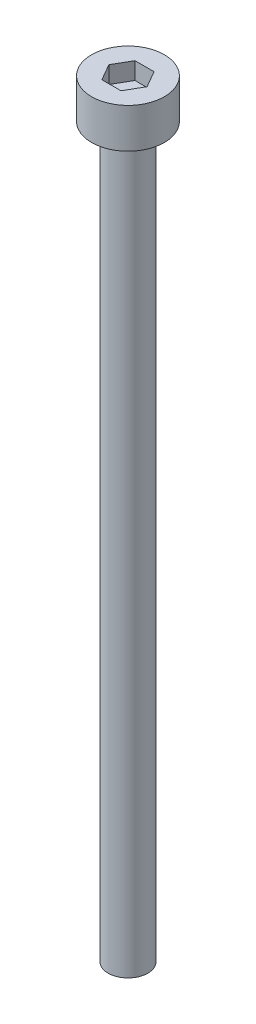
ISO-10303-21;
HEADER;
FILE_DESCRIPTION(('STEP AP214'),'2;1');
FILE_NAME('part.step','',(''),(''),'','','');
FILE_SCHEMA(('AUTOMOTIVE_DESIGN { 1 0 10303 214 1 1 1 1 }'));
ENDSEC;
DATA;
#1=APPLICATION_CONTEXT('core data for automotive mechanical design processes');
#2=APPLICATION_PROTOCOL_DEFINITION('international standard','automotive_design',2000,#1);
#3=PRODUCT_CONTEXT('',#1,'mechanical');
#4=PRODUCT('Part','Part','',(#3));
#5=PRODUCT_RELATED_PRODUCT_CATEGORY('part','',(#4));
#6=PRODUCT_DEFINITION_FORMATION('','',#4);
#7=PRODUCT_DEFINITION_CONTEXT('part definition',#1,'design');
#8=PRODUCT_DEFINITION('design','',#6,#7);
#9=PRODUCT_DEFINITION_SHAPE('','',#8);
#10=(LENGTH_UNIT() NAMED_UNIT(*) SI_UNIT(.MILLI.,.METRE.));
#11=(NAMED_UNIT(*) PLANE_ANGLE_UNIT() SI_UNIT($,.RADIAN.));
#12=(NAMED_UNIT(*) SI_UNIT($,.STERADIAN.) SOLID_ANGLE_UNIT());
#13=UNCERTAINTY_MEASURE_WITH_UNIT(LENGTH_MEASURE(1.E-05),#10,'distance_accuracy_value','');
#14=(GEOMETRIC_REPRESENTATION_CONTEXT(3) GLOBAL_UNCERTAINTY_ASSIGNED_CONTEXT((#13)) GLOBAL_UNIT_ASSIGNED_CONTEXT((#10,
#11,#12)) REPRESENTATION_CONTEXT('',''));
#15=CARTESIAN_POINT('',(0.,0.,0.));
#16=DIRECTION('',(0.,0.,1.));
#17=DIRECTION('',(1.,0.,0.));
#18=AXIS2_PLACEMENT_3D('',#15,#16,#17);
#19=CARTESIAN_POINT('',(0.,3.,0.));
#20=DIRECTION('',(0.,-1.,0.));
#21=DIRECTION('',(0.,0.,-1.));
#22=AXIS2_PLACEMENT_3D('',#19,#20,#21);
#23=CYLINDRICAL_SURFACE('',#22,2.75);
#24=CARTESIAN_POINT('',(0.,3.,0.));
#25=DIRECTION('',(0.,1.,0.));
#26=DIRECTION('',(0.,0.,1.));
#27=AXIS2_PLACEMENT_3D('',#24,#25,#26);
#28=CIRCLE('',#27,2.75);
#29=CARTESIAN_POINT('',(0.,3.,2.75));
#30=VERTEX_POINT('',#29);
#31=EDGE_CURVE('E45',#30,#30,#28,.T.);
#32=ORIENTED_EDGE('',*,*,#31,.F.);
#33=EDGE_LOOP('',(#32));
#34=FACE_BOUND('',#33,.T.);
#35=CARTESIAN_POINT('',(0.,0.,0.));
#36=DIRECTION('',(0.,1.,0.));
#37=DIRECTION('',(0.,0.,1.));
#38=AXIS2_PLACEMENT_3D('',#35,#36,#37);
#39=CIRCLE('',#38,2.75);
#40=CARTESIAN_POINT('',(0.,0.,2.75));
#41=VERTEX_POINT('',#40);
#42=EDGE_CURVE('E40',#41,#41,#39,.T.);
#43=ORIENTED_EDGE('',*,*,#42,.T.);
#44=EDGE_LOOP('',(#43));
#45=FACE_BOUND('',#44,.T.);
#46=ADVANCED_FACE('F37',(#34,#45),#23,.T.);
#47=CARTESIAN_POINT('',(0.,3.,0.));
#48=DIRECTION('',(0.,1.,0.));
#49=DIRECTION('',(0.,0.,1.));
#50=AXIS2_PLACEMENT_3D('',#47,#48,#49);
#51=PLANE('',#50);
#52=DIRECTION('',(0.5,0.,-0.866025403784439));
#53=VECTOR('',#52,1.);
#54=CARTESIAN_POINT('',(0.721687836487032,3.,1.25));
#55=LINE('',#54,#53);
#56=CARTESIAN_POINT('',(0.721687836487032,3.,1.25));
#57=VERTEX_POINT('',#56);
#58=CARTESIAN_POINT('',(1.44337567297406,3.,0.));
#59=VERTEX_POINT('',#58);
#60=EDGE_CURVE('E53',#57,#59,#55,.T.);
#61=ORIENTED_EDGE('',*,*,#60,.F.);
#62=DIRECTION('',(1.,0.,0.));
#63=VECTOR('',#62,1.);
#64=CARTESIAN_POINT('',(-0.721687836487033,3.,1.25));
#65=LINE('',#64,#63);
#66=CARTESIAN_POINT('',(-0.721687836487033,3.,1.25));
#67=VERTEX_POINT('',#66);
#68=EDGE_CURVE('E137',#67,#57,#65,.T.);
#69=ORIENTED_EDGE('',*,*,#68,.F.);
#70=DIRECTION('',(0.5,0.,0.866025403784439));
#71=VECTOR('',#70,1.);
#72=CARTESIAN_POINT('',(-1.44337567297407,3.,0.));
#73=LINE('',#72,#71);
#74=CARTESIAN_POINT('',(-1.44337567297407,3.,0.));
#75=VERTEX_POINT('',#74);
#76=EDGE_CURVE('E135',#75,#67,#73,.T.);
#77=ORIENTED_EDGE('',*,*,#76,.F.);
#78=DIRECTION('',(-0.5,0.,0.866025403784438));
#79=VECTOR('',#78,1.);
#80=CARTESIAN_POINT('',(-0.721687836487033,3.,-1.25));
#81=LINE('',#80,#79);
#82=CARTESIAN_POINT('',(-0.721687836487033,3.,-1.25));
#83=VERTEX_POINT('',#82);
#84=EDGE_CURVE('E101',#83,#75,#81,.T.);
#85=ORIENTED_EDGE('',*,*,#84,.F.);
#86=DIRECTION('',(-1.,0.,0.));
#87=VECTOR('',#86,1.);
#88=CARTESIAN_POINT('',(0.721687836487032,3.,-1.25));
#89=LINE('',#88,#87);
#90=CARTESIAN_POINT('',(0.721687836487032,3.,-1.25));
#91=VERTEX_POINT('',#90);
#92=EDGE_CURVE('E131',#91,#83,#89,.T.);
#93=ORIENTED_EDGE('',*,*,#92,.F.);
#94=DIRECTION('',(-0.5,0.,-0.866025403784439));
#95=VECTOR('',#94,1.);
#96=CARTESIAN_POINT('',(1.44337567297406,3.,0.));
#97=LINE('',#96,#95);
#98=EDGE_CURVE('E127',#59,#91,#97,.T.);
#99=ORIENTED_EDGE('',*,*,#98,.F.);
#100=EDGE_LOOP('',(#61,#69,#77,#85,#93,#99));
#101=FACE_BOUND('',#100,.T.);
#102=ORIENTED_EDGE('',*,*,#31,.T.);
#103=EDGE_LOOP('',(#102));
#104=FACE_BOUND('',#103,.T.);
#105=ADVANCED_FACE('F155',(#101,#104),#51,.T.);
#106=CARTESIAN_POINT('',(0.,0.,0.));
#107=DIRECTION('',(0.,1.,0.));
#108=DIRECTION('',(0.,0.,1.));
#109=AXIS2_PLACEMENT_3D('',#106,#107,#108);
#110=PLANE('',#109);
#111=CARTESIAN_POINT('',(0.,0.,0.));
#112=DIRECTION('',(0.,-1.,0.));
#113=DIRECTION('',(0.,0.,-1.));
#114=AXIS2_PLACEMENT_3D('',#111,#112,#113);
#115=CIRCLE('',#114,1.5);
#116=CARTESIAN_POINT('',(0.,0.,-1.5));
#117=VERTEX_POINT('',#116);
#118=EDGE_CURVE('E11',#117,#117,#115,.T.);
#119=ORIENTED_EDGE('',*,*,#118,.F.);
#120=EDGE_LOOP('',(#119));
#121=FACE_BOUND('',#120,.T.);
#122=ORIENTED_EDGE('',*,*,#42,.F.);
#123=EDGE_LOOP('',(#122));
#124=FACE_BOUND('',#123,.T.);
#125=ADVANCED_FACE('F152',(#121,#124),#110,.F.);
#126=CARTESIAN_POINT('',(0.721687836487032,1.7,1.25));
#127=DIRECTION('',(0.866025403784439,0.,0.5));
#128=DIRECTION('',(0.5,0.,-0.866025403784439));
#129=AXIS2_PLACEMENT_3D('',#126,#127,#128);
#130=PLANE('',#129);
#131=ORIENTED_EDGE('',*,*,#60,.T.);
#132=DIRECTION('',(0.,1.,0.));
#133=VECTOR('',#132,1.);
#134=CARTESIAN_POINT('',(1.44337567297406,1.7,0.));
#135=LINE('',#134,#133);
#136=CARTESIAN_POINT('',(1.44337567297406,1.7,0.));
#137=VERTEX_POINT('',#136);
#138=EDGE_CURVE('E83',#137,#59,#135,.T.);
#139=ORIENTED_EDGE('',*,*,#138,.F.);
#140=DIRECTION('',(0.5,0.,-0.866025403784439));
#141=VECTOR('',#140,1.);
#142=CARTESIAN_POINT('',(0.721687836487032,1.7,1.25));
#143=LINE('',#142,#141);
#144=CARTESIAN_POINT('',(0.721687836487032,1.7,1.25));
#145=VERTEX_POINT('',#144);
#146=EDGE_CURVE('E139',#145,#137,#143,.T.);
#147=ORIENTED_EDGE('',*,*,#146,.F.);
#148=DIRECTION('',(0.,1.,0.));
#149=VECTOR('',#148,1.);
#150=CARTESIAN_POINT('',(0.721687836487032,1.7,1.25));
#151=LINE('',#150,#149);
#152=EDGE_CURVE('E61',#145,#57,#151,.T.);
#153=ORIENTED_EDGE('',*,*,#152,.T.);
#154=EDGE_LOOP('',(#131,#139,#147,#153));
#155=FACE_BOUND('',#154,.T.);
#156=ADVANCED_FACE('F154',(#155),#130,.F.);
#157=CARTESIAN_POINT('',(-0.721687836487033,1.7,1.25));
#158=DIRECTION('',(0.,0.,1.));
#159=DIRECTION('',(1.,0.,0.));
#160=AXIS2_PLACEMENT_3D('',#157,#158,#159);
#161=PLANE('',#160);
#162=ORIENTED_EDGE('',*,*,#68,.T.);
#163=ORIENTED_EDGE('',*,*,#152,.F.);
#164=DIRECTION('',(1.,0.,0.));
#165=VECTOR('',#164,1.);
#166=CARTESIAN_POINT('',(-0.721687836487033,1.7,1.25));
#167=LINE('',#166,#165);
#168=CARTESIAN_POINT('',(-0.721687836487033,1.7,1.25));
#169=VERTEX_POINT('',#168);
#170=EDGE_CURVE('E113',#169,#145,#167,.T.);
#171=ORIENTED_EDGE('',*,*,#170,.F.);
#172=DIRECTION('',(0.,1.,0.));
#173=VECTOR('',#172,1.);
#174=CARTESIAN_POINT('',(-0.721687836487033,1.7,1.25));
#175=LINE('',#174,#173);
#176=EDGE_CURVE('E105',#169,#67,#175,.T.);
#177=ORIENTED_EDGE('',*,*,#176,.T.);
#178=EDGE_LOOP('',(#162,#163,#171,#177));
#179=FACE_BOUND('',#178,.T.);
#180=ADVANCED_FACE('F161',(#179),#161,.F.);
#181=CARTESIAN_POINT('',(-1.44337567297407,1.7,0.));
#182=DIRECTION('',(-0.866025403784439,0.,0.5));
#183=DIRECTION('',(0.5,0.,0.866025403784439));
#184=AXIS2_PLACEMENT_3D('',#181,#182,#183);
#185=PLANE('',#184);
#186=ORIENTED_EDGE('',*,*,#76,.T.);
#187=ORIENTED_EDGE('',*,*,#176,.F.);
#188=DIRECTION('',(0.5,0.,0.866025403784439));
#189=VECTOR('',#188,1.);
#190=CARTESIAN_POINT('',(-1.44337567297407,1.7,0.));
#191=LINE('',#190,#189);
#192=CARTESIAN_POINT('',(-1.44337567297407,1.7,0.));
#193=VERTEX_POINT('',#192);
#194=EDGE_CURVE('E109',#193,#169,#191,.T.);
#195=ORIENTED_EDGE('',*,*,#194,.F.);
#196=DIRECTION('',(0.,1.,0.));
#197=VECTOR('',#196,1.);
#198=CARTESIAN_POINT('',(-1.44337567297407,1.7,0.));
#199=LINE('',#198,#197);
#200=EDGE_CURVE('E94',#193,#75,#199,.T.);
#201=ORIENTED_EDGE('',*,*,#200,.T.);
#202=EDGE_LOOP('',(#186,#187,#195,#201));
#203=FACE_BOUND('',#202,.T.);
#204=ADVANCED_FACE('F110',(#203),#185,.F.);
#205=CARTESIAN_POINT('',(-0.721687836487033,1.7,-1.25));
#206=DIRECTION('',(-0.866025403784439,0.,-0.5));
#207=DIRECTION('',(-0.5,0.,0.866025403784439));
#208=AXIS2_PLACEMENT_3D('',#205,#206,#207);
#209=PLANE('',#208);
#210=ORIENTED_EDGE('',*,*,#84,.T.);
#211=ORIENTED_EDGE('',*,*,#200,.F.);
#212=DIRECTION('',(-0.5,0.,0.866025403784438));
#213=VECTOR('',#212,1.);
#214=CARTESIAN_POINT('',(-0.721687836487033,1.7,-1.25));
#215=LINE('',#214,#213);
#216=CARTESIAN_POINT('',(-0.721687836487033,1.7,-1.25));
#217=VERTEX_POINT('',#216);
#218=EDGE_CURVE('E98',#217,#193,#215,.T.);
#219=ORIENTED_EDGE('',*,*,#218,.F.);
#220=DIRECTION('',(0.,1.,0.));
#221=VECTOR('',#220,1.);
#222=CARTESIAN_POINT('',(-0.721687836487033,1.7,-1.25));
#223=LINE('',#222,#221);
#224=EDGE_CURVE('E106',#217,#83,#223,.T.);
#225=ORIENTED_EDGE('',*,*,#224,.T.);
#226=EDGE_LOOP('',(#210,#211,#219,#225));
#227=FACE_BOUND('',#226,.T.);
#228=ADVANCED_FACE('F96',(#227),#209,.F.);
#229=CARTESIAN_POINT('',(0.721687836487032,1.7,-1.25));
#230=DIRECTION('',(0.,0.,-1.));
#231=DIRECTION('',(-1.,0.,0.));
#232=AXIS2_PLACEMENT_3D('',#229,#230,#231);
#233=PLANE('',#232);
#234=ORIENTED_EDGE('',*,*,#92,.T.);
#235=ORIENTED_EDGE('',*,*,#224,.F.);
#236=DIRECTION('',(-1.,0.,0.));
#237=VECTOR('',#236,1.);
#238=CARTESIAN_POINT('',(0.721687836487032,1.7,-1.25));
#239=LINE('',#238,#237);
#240=CARTESIAN_POINT('',(0.721687836487032,1.7,-1.25));
#241=VERTEX_POINT('',#240);
#242=EDGE_CURVE('E119',#241,#217,#239,.T.);
#243=ORIENTED_EDGE('',*,*,#242,.F.);
#244=DIRECTION('',(0.,1.,0.));
#245=VECTOR('',#244,1.);
#246=CARTESIAN_POINT('',(0.721687836487032,1.7,-1.25));
#247=LINE('',#246,#245);
#248=EDGE_CURVE('E143',#241,#91,#247,.T.);
#249=ORIENTED_EDGE('',*,*,#248,.T.);
#250=EDGE_LOOP('',(#234,#235,#243,#249));
#251=FACE_BOUND('',#250,.T.);
#252=ADVANCED_FACE('F206',(#251),#233,.F.);
#253=CARTESIAN_POINT('',(1.44337567297406,1.7,0.));
#254=DIRECTION('',(0.866025403784439,0.,-0.5));
#255=DIRECTION('',(-0.5,0.,-0.866025403784439));
#256=AXIS2_PLACEMENT_3D('',#253,#254,#255);
#257=PLANE('',#256);
#258=ORIENTED_EDGE('',*,*,#98,.T.);
#259=ORIENTED_EDGE('',*,*,#248,.F.);
#260=DIRECTION('',(-0.5,0.,-0.866025403784439));
#261=VECTOR('',#260,1.);
#262=CARTESIAN_POINT('',(1.44337567297406,1.7,0.));
#263=LINE('',#262,#261);
#264=EDGE_CURVE('E121',#137,#241,#263,.T.);
#265=ORIENTED_EDGE('',*,*,#264,.F.);
#266=ORIENTED_EDGE('',*,*,#138,.T.);
#267=EDGE_LOOP('',(#258,#259,#265,#266));
#268=FACE_BOUND('',#267,.T.);
#269=ADVANCED_FACE('F215',(#268),#257,.F.);
#270=CARTESIAN_POINT('',(0.,1.7,0.));
#271=DIRECTION('',(0.,1.,0.));
#272=DIRECTION('',(0.,0.,1.));
#273=AXIS2_PLACEMENT_3D('',#270,#271,#272);
#274=PLANE('',#273);
#275=ORIENTED_EDGE('',*,*,#146,.T.);
#276=ORIENTED_EDGE('',*,*,#264,.T.);
#277=ORIENTED_EDGE('',*,*,#242,.T.);
#278=ORIENTED_EDGE('',*,*,#218,.T.);
#279=ORIENTED_EDGE('',*,*,#194,.T.);
#280=ORIENTED_EDGE('',*,*,#170,.T.);
#281=EDGE_LOOP('',(#275,#276,#277,#278,#279,#280));
#282=FACE_BOUND('',#281,.T.);
#283=ADVANCED_FACE('F116',(#282),#274,.T.);
#284=CARTESIAN_POINT('',(0.,-55.,0.));
#285=DIRECTION('',(0.,1.,0.));
#286=DIRECTION('',(0.,0.,1.));
#287=AXIS2_PLACEMENT_3D('',#284,#285,#286);
#288=CYLINDRICAL_SURFACE('',#287,1.5);
#289=CARTESIAN_POINT('',(0.,-55.,0.));
#290=DIRECTION('',(0.,-1.,0.));
#291=DIRECTION('',(0.,0.,-1.));
#292=AXIS2_PLACEMENT_3D('',#289,#290,#291);
#293=CIRCLE('',#292,1.5);
#294=CARTESIAN_POINT('',(0.,-55.,-1.5));
#295=VERTEX_POINT('',#294);
#296=EDGE_CURVE('E128',#295,#295,#293,.T.);
#297=ORIENTED_EDGE('',*,*,#296,.F.);
#298=EDGE_LOOP('',(#297));
#299=FACE_BOUND('',#298,.T.);
#300=ORIENTED_EDGE('',*,*,#118,.T.);
#301=EDGE_LOOP('',(#300));
#302=FACE_BOUND('',#301,.T.);
#303=ADVANCED_FACE('F233',(#299,#302),#288,.T.);
#304=CARTESIAN_POINT('',(0.,-55.,0.));
#305=DIRECTION('',(0.,-1.,0.));
#306=DIRECTION('',(0.,0.,-1.));
#307=AXIS2_PLACEMENT_3D('',#304,#305,#306);
#308=PLANE('',#307);
#309=ORIENTED_EDGE('',*,*,#296,.T.);
#310=EDGE_LOOP('',(#309));
#311=FACE_BOUND('',#310,.T.);
#312=ADVANCED_FACE('F247',(#311),#308,.T.);
#313=CLOSED_SHELL('',(#46,#105,#125,#156,#180,#204,#228,#252,#269,#283,#303,#312));
#314=MANIFOLD_SOLID_BREP('B2',#313);
#315=ADVANCED_BREP_SHAPE_REPRESENTATION('',(#18,#314),#14);
#316=SHAPE_DEFINITION_REPRESENTATION(#9,#315);
ENDSEC;
END-ISO-10303-21;
